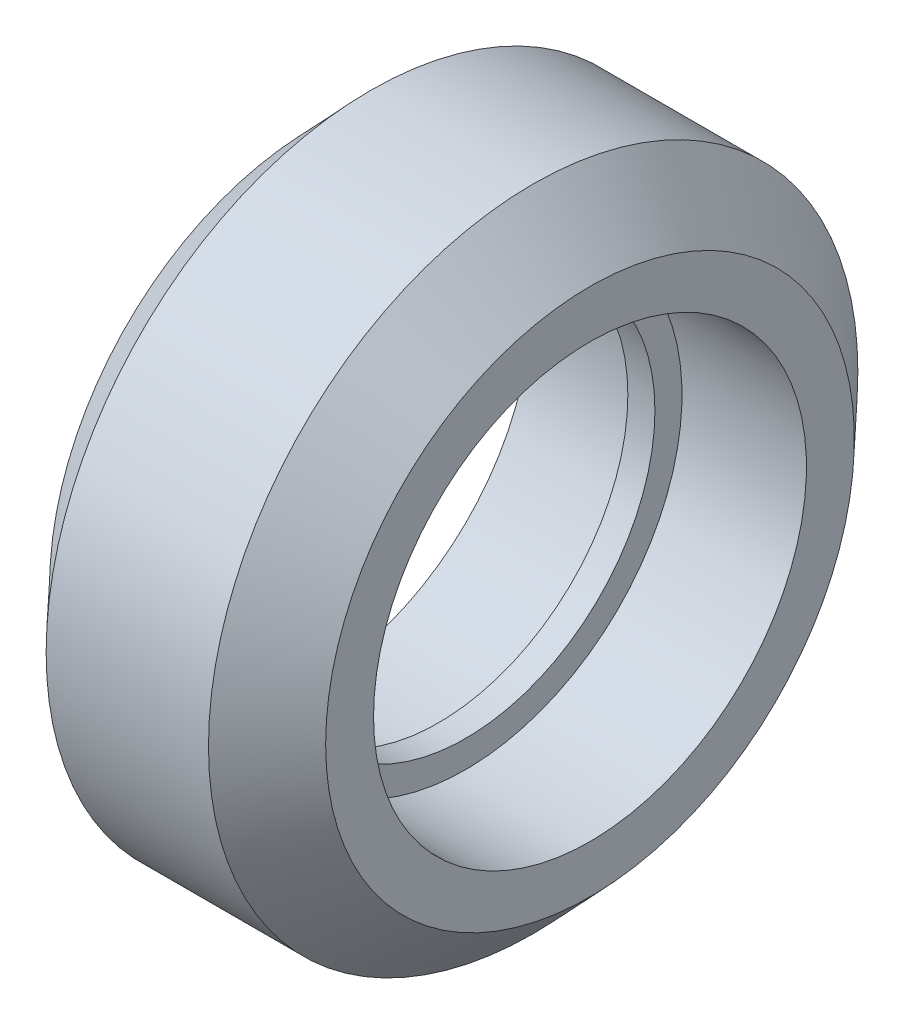
ISO-10303-21;
HEADER;
FILE_DESCRIPTION(('STEP AP214'),'2;1');
FILE_NAME('part.step','',(''),(''),'','','');
FILE_SCHEMA(('AUTOMOTIVE_DESIGN { 1 0 10303 214 1 1 1 1 }'));
ENDSEC;
DATA;
#1=APPLICATION_CONTEXT('core data for automotive mechanical design processes');
#2=APPLICATION_PROTOCOL_DEFINITION('international standard','automotive_design',2000,#1);
#3=PRODUCT_CONTEXT('',#1,'mechanical');
#4=PRODUCT('Part','Part','',(#3));
#5=PRODUCT_RELATED_PRODUCT_CATEGORY('part','',(#4));
#6=PRODUCT_DEFINITION_FORMATION('','',#4);
#7=PRODUCT_DEFINITION_CONTEXT('part definition',#1,'design');
#8=PRODUCT_DEFINITION('design','',#6,#7);
#9=PRODUCT_DEFINITION_SHAPE('','',#8);
#10=(LENGTH_UNIT() NAMED_UNIT(*) SI_UNIT(.MILLI.,.METRE.));
#11=(NAMED_UNIT(*) PLANE_ANGLE_UNIT() SI_UNIT($,.RADIAN.));
#12=(NAMED_UNIT(*) SI_UNIT($,.STERADIAN.) SOLID_ANGLE_UNIT());
#13=UNCERTAINTY_MEASURE_WITH_UNIT(LENGTH_MEASURE(1.E-05),#10,'distance_accuracy_value','');
#14=(GEOMETRIC_REPRESENTATION_CONTEXT(3) GLOBAL_UNCERTAINTY_ASSIGNED_CONTEXT((#13)) GLOBAL_UNIT_ASSIGNED_CONTEXT((#10,
#11,#12)) REPRESENTATION_CONTEXT('',''));
#15=CARTESIAN_POINT('',(0.,0.,0.));
#16=DIRECTION('',(0.,0.,1.));
#17=DIRECTION('',(1.,0.,0.));
#18=AXIS2_PLACEMENT_3D('',#15,#16,#17);
#19=CARTESIAN_POINT('',(5.1,0.,0.));
#20=DIRECTION('',(-1.,0.,0.));
#21=DIRECTION('',(0.,0.,1.));
#22=AXIS2_PLACEMENT_3D('',#19,#20,#21);
#23=CONICAL_SURFACE('',#22,9.77,0.815412242160042);
#24=CARTESIAN_POINT('',(3.,0.,0.));
#25=DIRECTION('',(-1.,0.,0.));
#26=DIRECTION('',(0.,0.,1.));
#27=AXIS2_PLACEMENT_3D('',#24,#25,#26);
#28=CIRCLE('',#27,12.);
#29=CARTESIAN_POINT('',(3.,0.,12.));
#30=VERTEX_POINT('',#29);
#31=EDGE_CURVE('E66',#30,#30,#28,.T.);
#32=ORIENTED_EDGE('',*,*,#31,.F.);
#33=EDGE_LOOP('',(#32));
#34=FACE_BOUND('',#33,.T.);
#35=CARTESIAN_POINT('',(5.1,0.,0.));
#36=DIRECTION('',(-1.,0.,0.));
#37=DIRECTION('',(0.,0.,1.));
#38=AXIS2_PLACEMENT_3D('',#35,#36,#37);
#39=CIRCLE('',#38,9.77);
#40=CARTESIAN_POINT('',(5.1,0.,9.77));
#41=VERTEX_POINT('',#40);
#42=EDGE_CURVE('E10',#41,#41,#39,.T.);
#43=ORIENTED_EDGE('',*,*,#42,.T.);
#44=EDGE_LOOP('',(#43));
#45=FACE_BOUND('',#44,.T.);
#46=ADVANCED_FACE('F32',(#34,#45),#23,.T.);
#47=CARTESIAN_POINT('',(5.1,9.77,0.));
#48=DIRECTION('',(-1.,0.,0.));
#49=DIRECTION('',(0.,0.,1.));
#50=AXIS2_PLACEMENT_3D('',#47,#48,#49);
#51=PLANE('',#50);
#52=ORIENTED_EDGE('',*,*,#42,.F.);
#53=EDGE_LOOP('',(#52));
#54=FACE_BOUND('',#53,.T.);
#55=CARTESIAN_POINT('',(5.1,0.,0.));
#56=DIRECTION('',(-1.,0.,0.));
#57=DIRECTION('',(0.,0.,1.));
#58=AXIS2_PLACEMENT_3D('',#55,#56,#57);
#59=CIRCLE('',#58,8.);
#60=CARTESIAN_POINT('',(5.1,0.,8.));
#61=VERTEX_POINT('',#60);
#62=EDGE_CURVE('E38',#61,#61,#59,.T.);
#63=ORIENTED_EDGE('',*,*,#62,.T.);
#64=EDGE_LOOP('',(#63));
#65=FACE_BOUND('',#64,.T.);
#66=ADVANCED_FACE('F73',(#54,#65),#51,.F.);
#67=CARTESIAN_POINT('',(-3.43352221823337,0.,0.));
#68=DIRECTION('',(-1.,0.,0.));
#69=DIRECTION('',(0.,0.,1.));
#70=AXIS2_PLACEMENT_3D('',#67,#68,#69);
#71=CYLINDRICAL_SURFACE('',#70,8.);
#72=ORIENTED_EDGE('',*,*,#62,.F.);
#73=EDGE_LOOP('',(#72));
#74=FACE_BOUND('',#73,.T.);
#75=CARTESIAN_POINT('',(0.5,0.,0.));
#76=DIRECTION('',(-1.,0.,0.));
#77=DIRECTION('',(0.,0.,1.));
#78=AXIS2_PLACEMENT_3D('',#75,#76,#77);
#79=CIRCLE('',#78,8.);
#80=CARTESIAN_POINT('',(0.5,0.,8.));
#81=VERTEX_POINT('',#80);
#82=EDGE_CURVE('E42',#81,#81,#79,.T.);
#83=ORIENTED_EDGE('',*,*,#82,.T.);
#84=EDGE_LOOP('',(#83));
#85=FACE_BOUND('',#84,.T.);
#86=ADVANCED_FACE('F77',(#74,#85),#71,.F.);
#87=CARTESIAN_POINT('',(0.5,8.,0.));
#88=DIRECTION('',(-1.,0.,0.));
#89=DIRECTION('',(0.,0.,1.));
#90=AXIS2_PLACEMENT_3D('',#87,#88,#89);
#91=PLANE('',#90);
#92=ORIENTED_EDGE('',*,*,#82,.F.);
#93=EDGE_LOOP('',(#92));
#94=FACE_BOUND('',#93,.T.);
#95=CARTESIAN_POINT('',(0.5,0.,0.));
#96=DIRECTION('',(-1.,0.,0.));
#97=DIRECTION('',(0.,0.,1.));
#98=AXIS2_PLACEMENT_3D('',#95,#96,#97);
#99=CIRCLE('',#98,7.);
#100=CARTESIAN_POINT('',(0.5,0.,7.));
#101=VERTEX_POINT('',#100);
#102=EDGE_CURVE('E46',#101,#101,#99,.T.);
#103=ORIENTED_EDGE('',*,*,#102,.T.);
#104=EDGE_LOOP('',(#103));
#105=FACE_BOUND('',#104,.T.);
#106=ADVANCED_FACE('F82',(#94,#105),#91,.F.);
#107=CARTESIAN_POINT('',(-3.43352221823337,0.,0.));
#108=DIRECTION('',(-1.,0.,0.));
#109=DIRECTION('',(0.,0.,1.));
#110=AXIS2_PLACEMENT_3D('',#107,#108,#109);
#111=CYLINDRICAL_SURFACE('',#110,7.);
#112=ORIENTED_EDGE('',*,*,#102,.F.);
#113=EDGE_LOOP('',(#112));
#114=FACE_BOUND('',#113,.T.);
#115=CARTESIAN_POINT('',(-0.5,0.,0.));
#116=DIRECTION('',(-1.,0.,0.));
#117=DIRECTION('',(0.,0.,1.));
#118=AXIS2_PLACEMENT_3D('',#115,#116,#117);
#119=CIRCLE('',#118,7.);
#120=CARTESIAN_POINT('',(-0.5,0.,7.));
#121=VERTEX_POINT('',#120);
#122=EDGE_CURVE('E51',#121,#121,#119,.T.);
#123=ORIENTED_EDGE('',*,*,#122,.T.);
#124=EDGE_LOOP('',(#123));
#125=FACE_BOUND('',#124,.T.);
#126=ADVANCED_FACE('F88',(#114,#125),#111,.F.);
#127=CARTESIAN_POINT('',(-0.5,8.,0.));
#128=DIRECTION('',(1.,0.,0.));
#129=DIRECTION('',(0.,0.,-1.));
#130=AXIS2_PLACEMENT_3D('',#127,#128,#129);
#131=PLANE('',#130);
#132=ORIENTED_EDGE('',*,*,#122,.F.);
#133=EDGE_LOOP('',(#132));
#134=FACE_BOUND('',#133,.T.);
#135=CARTESIAN_POINT('',(-0.5,0.,0.));
#136=DIRECTION('',(-1.,0.,0.));
#137=DIRECTION('',(0.,0.,1.));
#138=AXIS2_PLACEMENT_3D('',#135,#136,#137);
#139=CIRCLE('',#138,8.);
#140=CARTESIAN_POINT('',(-0.5,0.,8.));
#141=VERTEX_POINT('',#140);
#142=EDGE_CURVE('E54',#141,#141,#139,.T.);
#143=ORIENTED_EDGE('',*,*,#142,.T.);
#144=EDGE_LOOP('',(#143));
#145=FACE_BOUND('',#144,.T.);
#146=ADVANCED_FACE('F92',(#134,#145),#131,.F.);
#147=CARTESIAN_POINT('',(-3.43352221823337,0.,0.));
#148=DIRECTION('',(-1.,0.,0.));
#149=DIRECTION('',(0.,0.,1.));
#150=AXIS2_PLACEMENT_3D('',#147,#148,#149);
#151=CYLINDRICAL_SURFACE('',#150,8.);
#152=ORIENTED_EDGE('',*,*,#142,.F.);
#153=EDGE_LOOP('',(#152));
#154=FACE_BOUND('',#153,.T.);
#155=CARTESIAN_POINT('',(-5.1,0.,0.));
#156=DIRECTION('',(-1.,0.,0.));
#157=DIRECTION('',(0.,0.,1.));
#158=AXIS2_PLACEMENT_3D('',#155,#156,#157);
#159=CIRCLE('',#158,8.);
#160=CARTESIAN_POINT('',(-5.1,0.,8.));
#161=VERTEX_POINT('',#160);
#162=EDGE_CURVE('E57',#161,#161,#159,.T.);
#163=ORIENTED_EDGE('',*,*,#162,.T.);
#164=EDGE_LOOP('',(#163));
#165=FACE_BOUND('',#164,.T.);
#166=ADVANCED_FACE('F96',(#154,#165),#151,.F.);
#167=CARTESIAN_POINT('',(-5.1,9.77,0.));
#168=DIRECTION('',(1.,0.,0.));
#169=DIRECTION('',(0.,0.,-1.));
#170=AXIS2_PLACEMENT_3D('',#167,#168,#169);
#171=PLANE('',#170);
#172=ORIENTED_EDGE('',*,*,#162,.F.);
#173=EDGE_LOOP('',(#172));
#174=FACE_BOUND('',#173,.T.);
#175=CARTESIAN_POINT('',(-5.1,0.,0.));
#176=DIRECTION('',(-1.,0.,0.));
#177=DIRECTION('',(0.,0.,1.));
#178=AXIS2_PLACEMENT_3D('',#175,#176,#177);
#179=CIRCLE('',#178,9.77);
#180=CARTESIAN_POINT('',(-5.1,0.,9.77));
#181=VERTEX_POINT('',#180);
#182=EDGE_CURVE('E60',#181,#181,#179,.T.);
#183=ORIENTED_EDGE('',*,*,#182,.T.);
#184=EDGE_LOOP('',(#183));
#185=FACE_BOUND('',#184,.T.);
#186=ADVANCED_FACE('F100',(#174,#185),#171,.F.);
#187=CARTESIAN_POINT('',(-3.,0.,0.));
#188=DIRECTION('',(1.,0.,0.));
#189=DIRECTION('',(0.,0.,-1.));
#190=AXIS2_PLACEMENT_3D('',#187,#188,#189);
#191=CONICAL_SURFACE('',#190,12.,0.815412242160042);
#192=ORIENTED_EDGE('',*,*,#182,.F.);
#193=EDGE_LOOP('',(#192));
#194=FACE_BOUND('',#193,.T.);
#195=CARTESIAN_POINT('',(-3.,0.,0.));
#196=DIRECTION('',(-1.,0.,0.));
#197=DIRECTION('',(0.,0.,1.));
#198=AXIS2_PLACEMENT_3D('',#195,#196,#197);
#199=CIRCLE('',#198,12.);
#200=CARTESIAN_POINT('',(-3.,0.,12.));
#201=VERTEX_POINT('',#200);
#202=EDGE_CURVE('E63',#201,#201,#199,.T.);
#203=ORIENTED_EDGE('',*,*,#202,.T.);
#204=EDGE_LOOP('',(#203));
#205=FACE_BOUND('',#204,.T.);
#206=ADVANCED_FACE('F104',(#194,#205),#191,.T.);
#207=CARTESIAN_POINT('',(-3.43352221823337,0.,0.));
#208=DIRECTION('',(-1.,0.,0.));
#209=DIRECTION('',(0.,0.,1.));
#210=AXIS2_PLACEMENT_3D('',#207,#208,#209);
#211=CYLINDRICAL_SURFACE('',#210,12.);
#212=ORIENTED_EDGE('',*,*,#202,.F.);
#213=EDGE_LOOP('',(#212));
#214=FACE_BOUND('',#213,.T.);
#215=ORIENTED_EDGE('',*,*,#31,.T.);
#216=EDGE_LOOP('',(#215));
#217=FACE_BOUND('',#216,.T.);
#218=ADVANCED_FACE('F70',(#214,#217),#211,.T.);
#219=CLOSED_SHELL('',(#46,#66,#86,#106,#126,#146,#166,#186,#206,#218));
#220=MANIFOLD_SOLID_BREP('B2',#219);
#221=ADVANCED_BREP_SHAPE_REPRESENTATION('',(#18,#220),#14);
#222=SHAPE_DEFINITION_REPRESENTATION(#9,#221);
ENDSEC;
END-ISO-10303-21;
